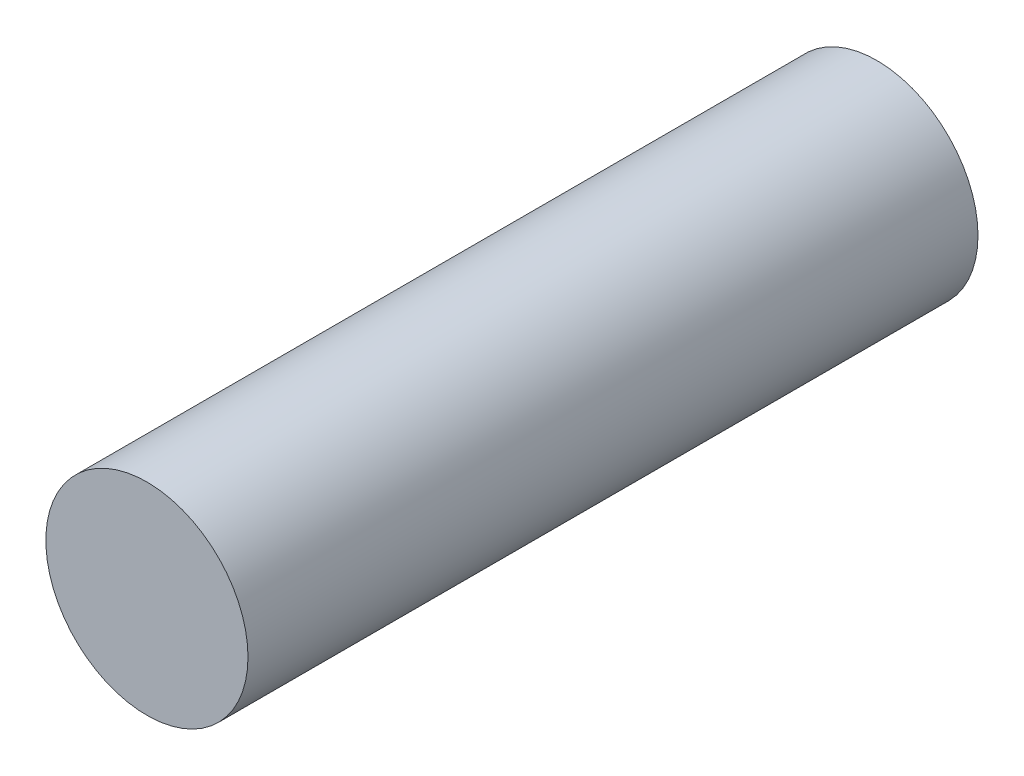
ISO-10303-21;
HEADER;
FILE_DESCRIPTION(('STEP AP214'),'2;1');
FILE_NAME('part.step','',(''),(''),'','','');
FILE_SCHEMA(('AUTOMOTIVE_DESIGN { 1 0 10303 214 1 1 1 1 }'));
ENDSEC;
DATA;
#1=APPLICATION_CONTEXT('core data for automotive mechanical design processes');
#2=APPLICATION_PROTOCOL_DEFINITION('international standard','automotive_design',2000,#1);
#3=PRODUCT_CONTEXT('',#1,'mechanical');
#4=PRODUCT('Part','Part','',(#3));
#5=PRODUCT_RELATED_PRODUCT_CATEGORY('part','',(#4));
#6=PRODUCT_DEFINITION_FORMATION('','',#4);
#7=PRODUCT_DEFINITION_CONTEXT('part definition',#1,'design');
#8=PRODUCT_DEFINITION('design','',#6,#7);
#9=PRODUCT_DEFINITION_SHAPE('','',#8);
#10=(LENGTH_UNIT() NAMED_UNIT(*) SI_UNIT(.MILLI.,.METRE.));
#11=(NAMED_UNIT(*) PLANE_ANGLE_UNIT() SI_UNIT($,.RADIAN.));
#12=(NAMED_UNIT(*) SI_UNIT($,.STERADIAN.) SOLID_ANGLE_UNIT());
#13=UNCERTAINTY_MEASURE_WITH_UNIT(LENGTH_MEASURE(1.E-05),#10,'distance_accuracy_value','');
#14=(GEOMETRIC_REPRESENTATION_CONTEXT(3) GLOBAL_UNCERTAINTY_ASSIGNED_CONTEXT((#13)) GLOBAL_UNIT_ASSIGNED_CONTEXT((#10,
#11,#12)) REPRESENTATION_CONTEXT('',''));
#15=CARTESIAN_POINT('',(0.,0.,0.));
#16=DIRECTION('',(0.,0.,1.));
#17=DIRECTION('',(1.,0.,0.));
#18=AXIS2_PLACEMENT_3D('',#15,#16,#17);
#19=CARTESIAN_POINT('',(0.,0.,65.));
#20=DIRECTION('',(0.,0.,-1.));
#21=DIRECTION('',(-1.,0.,0.));
#22=AXIS2_PLACEMENT_3D('',#19,#20,#21);
#23=CYLINDRICAL_SURFACE('',#22,9.);
#24=CARTESIAN_POINT('',(0.,0.,65.));
#25=DIRECTION('',(0.,0.,1.));
#26=DIRECTION('',(1.,0.,0.));
#27=AXIS2_PLACEMENT_3D('',#24,#25,#26);
#28=CIRCLE('',#27,9.);
#29=CARTESIAN_POINT('',(9.,0.,65.));
#30=VERTEX_POINT('',#29);
#31=EDGE_CURVE('E10',#30,#30,#28,.T.);
#32=ORIENTED_EDGE('',*,*,#31,.F.);
#33=EDGE_LOOP('',(#32));
#34=FACE_BOUND('',#33,.T.);
#35=CARTESIAN_POINT('',(0.,0.,0.));
#36=DIRECTION('',(0.,0.,1.));
#37=DIRECTION('',(1.,0.,0.));
#38=AXIS2_PLACEMENT_3D('',#35,#36,#37);
#39=CIRCLE('',#38,9.);
#40=CARTESIAN_POINT('',(9.,0.,0.));
#41=VERTEX_POINT('',#40);
#42=EDGE_CURVE('E35',#41,#41,#39,.T.);
#43=ORIENTED_EDGE('',*,*,#42,.T.);
#44=EDGE_LOOP('',(#43));
#45=FACE_BOUND('',#44,.T.);
#46=ADVANCED_FACE('F32',(#34,#45),#23,.T.);
#47=CARTESIAN_POINT('',(0.,0.,65.));
#48=DIRECTION('',(0.,0.,1.));
#49=DIRECTION('',(1.,0.,0.));
#50=AXIS2_PLACEMENT_3D('',#47,#48,#49);
#51=PLANE('',#50);
#52=ORIENTED_EDGE('',*,*,#31,.T.);
#53=EDGE_LOOP('',(#52));
#54=FACE_BOUND('',#53,.T.);
#55=ADVANCED_FACE('F47',(#54),#51,.T.);
#56=CARTESIAN_POINT('',(0.,0.,0.));
#57=DIRECTION('',(0.,0.,1.));
#58=DIRECTION('',(1.,0.,0.));
#59=AXIS2_PLACEMENT_3D('',#56,#57,#58);
#60=PLANE('',#59);
#61=ORIENTED_EDGE('',*,*,#42,.F.);
#62=EDGE_LOOP('',(#61));
#63=FACE_BOUND('',#62,.T.);
#64=ADVANCED_FACE('F45',(#63),#60,.F.);
#65=CLOSED_SHELL('',(#46,#55,#64));
#66=MANIFOLD_SOLID_BREP('B2',#65);
#67=ADVANCED_BREP_SHAPE_REPRESENTATION('',(#18,#66),#14);
#68=SHAPE_DEFINITION_REPRESENTATION(#9,#67);
ENDSEC;
END-ISO-10303-21;
